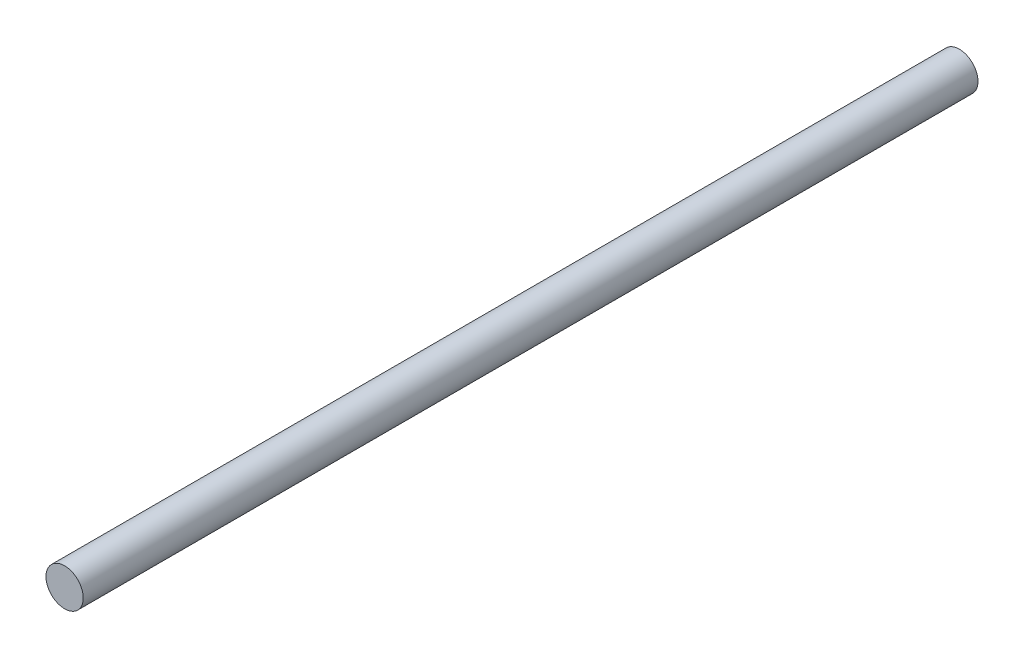
ISO-10303-21;
HEADER;
FILE_DESCRIPTION(('STEP AP214'),'2;1');
FILE_NAME('part.step','',(''),(''),'','','');
FILE_SCHEMA(('AUTOMOTIVE_DESIGN { 1 0 10303 214 1 1 1 1 }'));
ENDSEC;
DATA;
#1=APPLICATION_CONTEXT('core data for automotive mechanical design processes');
#2=APPLICATION_PROTOCOL_DEFINITION('international standard','automotive_design',2000,#1);
#3=PRODUCT_CONTEXT('',#1,'mechanical');
#4=PRODUCT('Part','Part','',(#3));
#5=PRODUCT_RELATED_PRODUCT_CATEGORY('part','',(#4));
#6=PRODUCT_DEFINITION_FORMATION('','',#4);
#7=PRODUCT_DEFINITION_CONTEXT('part definition',#1,'design');
#8=PRODUCT_DEFINITION('design','',#6,#7);
#9=PRODUCT_DEFINITION_SHAPE('','',#8);
#10=(LENGTH_UNIT() NAMED_UNIT(*) SI_UNIT(.MILLI.,.METRE.));
#11=(NAMED_UNIT(*) PLANE_ANGLE_UNIT() SI_UNIT($,.RADIAN.));
#12=(NAMED_UNIT(*) SI_UNIT($,.STERADIAN.) SOLID_ANGLE_UNIT());
#13=UNCERTAINTY_MEASURE_WITH_UNIT(LENGTH_MEASURE(1.E-05),#10,'distance_accuracy_value','');
#14=(GEOMETRIC_REPRESENTATION_CONTEXT(3) GLOBAL_UNCERTAINTY_ASSIGNED_CONTEXT((#13)) GLOBAL_UNIT_ASSIGNED_CONTEXT((#10,
#11,#12)) REPRESENTATION_CONTEXT('',''));
#15=CARTESIAN_POINT('',(0.,0.,0.));
#16=DIRECTION('',(0.,0.,1.));
#17=DIRECTION('',(1.,0.,0.));
#18=AXIS2_PLACEMENT_3D('',#15,#16,#17);
#19=CARTESIAN_POINT('',(0.,0.,-457.2));
#20=DIRECTION('',(0.,0.,1.));
#21=DIRECTION('',(1.,0.,0.));
#22=AXIS2_PLACEMENT_3D('',#19,#20,#21);
#23=CYLINDRICAL_SURFACE('',#22,19.05);
#24=CARTESIAN_POINT('',(0.,0.,-457.2));
#25=DIRECTION('',(0.,0.,1.));
#26=DIRECTION('',(1.,0.,0.));
#27=AXIS2_PLACEMENT_3D('',#24,#25,#26);
#28=CIRCLE('',#27,19.05);
#29=CARTESIAN_POINT('',(19.05,0.,-457.2));
#30=VERTEX_POINT('',#29);
#31=EDGE_CURVE('E10',#30,#30,#28,.T.);
#32=ORIENTED_EDGE('',*,*,#31,.T.);
#33=EDGE_LOOP('',(#32));
#34=FACE_BOUND('',#33,.T.);
#35=CARTESIAN_POINT('',(0.,0.,457.2));
#36=DIRECTION('',(0.,0.,1.));
#37=DIRECTION('',(1.,0.,0.));
#38=AXIS2_PLACEMENT_3D('',#35,#36,#37);
#39=CIRCLE('',#38,19.05);
#40=CARTESIAN_POINT('',(19.05,0.,457.2));
#41=VERTEX_POINT('',#40);
#42=EDGE_CURVE('E44',#41,#41,#39,.T.);
#43=ORIENTED_EDGE('',*,*,#42,.F.);
#44=EDGE_LOOP('',(#43));
#45=FACE_BOUND('',#44,.T.);
#46=ADVANCED_FACE('F37',(#34,#45),#23,.T.);
#47=CARTESIAN_POINT('',(0.,0.,-457.2));
#48=DIRECTION('',(0.,0.,1.));
#49=DIRECTION('',(1.,0.,0.));
#50=AXIS2_PLACEMENT_3D('',#47,#48,#49);
#51=PLANE('',#50);
#52=ORIENTED_EDGE('',*,*,#31,.F.);
#53=EDGE_LOOP('',(#52));
#54=FACE_BOUND('',#53,.T.);
#55=ADVANCED_FACE('F54',(#54),#51,.F.);
#56=CARTESIAN_POINT('',(0.,0.,457.2));
#57=DIRECTION('',(0.,0.,1.));
#58=DIRECTION('',(1.,0.,0.));
#59=AXIS2_PLACEMENT_3D('',#56,#57,#58);
#60=PLANE('',#59);
#61=ORIENTED_EDGE('',*,*,#42,.T.);
#62=EDGE_LOOP('',(#61));
#63=FACE_BOUND('',#62,.T.);
#64=ADVANCED_FACE('F51',(#63),#60,.T.);
#65=CLOSED_SHELL('',(#46,#55,#64));
#66=MANIFOLD_SOLID_BREP('B2',#65);
#67=ADVANCED_BREP_SHAPE_REPRESENTATION('',(#18,#66),#14);
#68=SHAPE_DEFINITION_REPRESENTATION(#9,#67);
ENDSEC;
END-ISO-10303-21;
